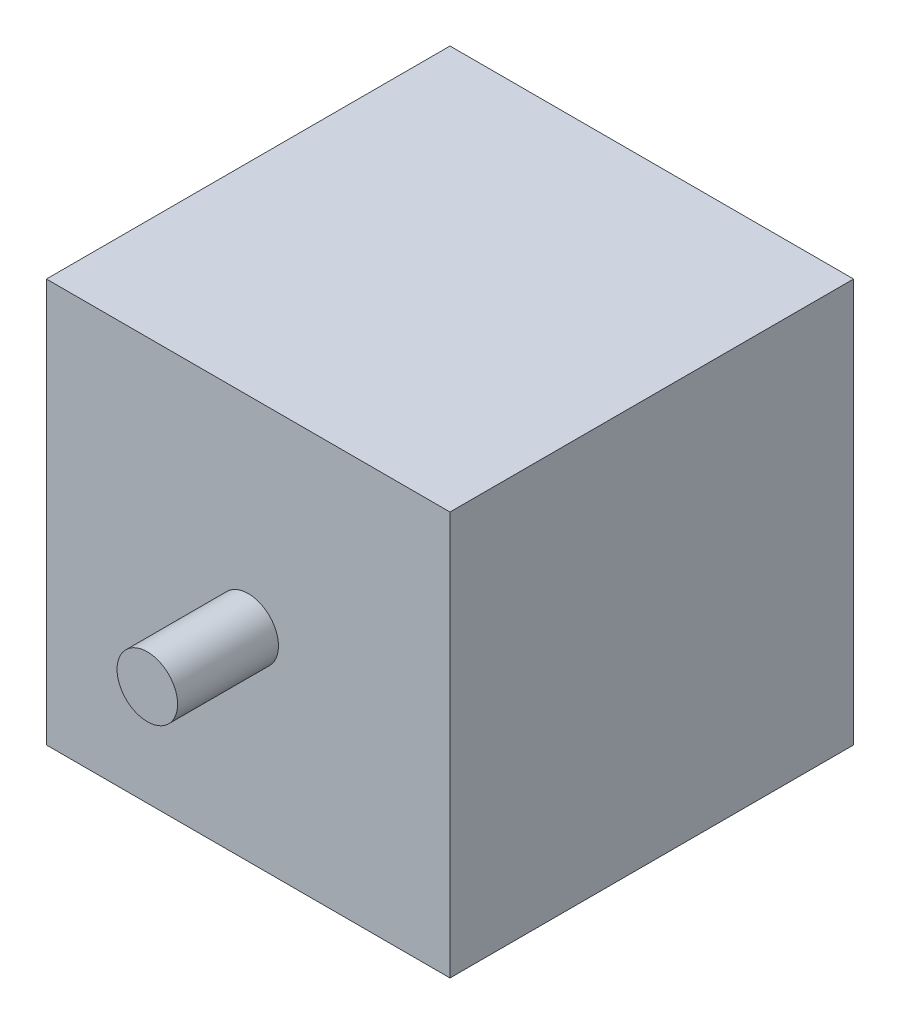
ISO-10303-21;
HEADER;
FILE_DESCRIPTION(('STEP AP214'),'2;1');
FILE_NAME('part.step','',(''),(''),'','','');
FILE_SCHEMA(('AUTOMOTIVE_DESIGN { 1 0 10303 214 1 1 1 1 }'));
ENDSEC;
DATA;
#1=APPLICATION_CONTEXT('core data for automotive mechanical design processes');
#2=APPLICATION_PROTOCOL_DEFINITION('international standard','automotive_design',2000,#1);
#3=PRODUCT_CONTEXT('',#1,'mechanical');
#4=PRODUCT('Part','Part','',(#3));
#5=PRODUCT_RELATED_PRODUCT_CATEGORY('part','',(#4));
#6=PRODUCT_DEFINITION_FORMATION('','',#4);
#7=PRODUCT_DEFINITION_CONTEXT('part definition',#1,'design');
#8=PRODUCT_DEFINITION('design','',#6,#7);
#9=PRODUCT_DEFINITION_SHAPE('','',#8);
#10=(LENGTH_UNIT() NAMED_UNIT(*) SI_UNIT(.MILLI.,.METRE.));
#11=(NAMED_UNIT(*) PLANE_ANGLE_UNIT() SI_UNIT($,.RADIAN.));
#12=(NAMED_UNIT(*) SI_UNIT($,.STERADIAN.) SOLID_ANGLE_UNIT());
#13=UNCERTAINTY_MEASURE_WITH_UNIT(LENGTH_MEASURE(1.E-05),#10,'distance_accuracy_value','');
#14=(GEOMETRIC_REPRESENTATION_CONTEXT(3) GLOBAL_UNCERTAINTY_ASSIGNED_CONTEXT((#13)) GLOBAL_UNIT_ASSIGNED_CONTEXT((#10,
#11,#12)) REPRESENTATION_CONTEXT('',''));
#15=CARTESIAN_POINT('',(0.,0.,0.));
#16=DIRECTION('',(0.,0.,1.));
#17=DIRECTION('',(1.,0.,0.));
#18=AXIS2_PLACEMENT_3D('',#15,#16,#17);
#19=CARTESIAN_POINT('',(20.,-20.,40.));
#20=DIRECTION('',(-1.,0.,0.));
#21=DIRECTION('',(0.,0.,1.));
#22=AXIS2_PLACEMENT_3D('',#19,#20,#21);
#23=PLANE('',#22);
#24=DIRECTION('',(0.,1.,0.));
#25=VECTOR('',#24,1.);
#26=CARTESIAN_POINT('',(20.,-20.,0.));
#27=LINE('',#26,#25);
#28=CARTESIAN_POINT('',(20.,-20.,0.));
#29=VERTEX_POINT('',#28);
#30=CARTESIAN_POINT('',(20.,20.,0.));
#31=VERTEX_POINT('',#30);
#32=EDGE_CURVE('E98',#29,#31,#27,.T.);
#33=ORIENTED_EDGE('',*,*,#32,.T.);
#34=DIRECTION('',(0.,0.,-1.));
#35=VECTOR('',#34,1.);
#36=CARTESIAN_POINT('',(20.,20.,40.));
#37=LINE('',#36,#35);
#38=CARTESIAN_POINT('',(20.,20.,40.));
#39=VERTEX_POINT('',#38);
#40=EDGE_CURVE('E40',#39,#31,#37,.T.);
#41=ORIENTED_EDGE('',*,*,#40,.F.);
#42=DIRECTION('',(0.,1.,0.));
#43=VECTOR('',#42,1.);
#44=CARTESIAN_POINT('',(20.,-20.,40.));
#45=LINE('',#44,#43);
#46=CARTESIAN_POINT('',(20.,-20.,40.));
#47=VERTEX_POINT('',#46);
#48=EDGE_CURVE('E84',#47,#39,#45,.T.);
#49=ORIENTED_EDGE('',*,*,#48,.F.);
#50=DIRECTION('',(0.,0.,-1.));
#51=VECTOR('',#50,1.);
#52=CARTESIAN_POINT('',(20.,-20.,40.));
#53=LINE('',#52,#51);
#54=EDGE_CURVE('E94',#47,#29,#53,.T.);
#55=ORIENTED_EDGE('',*,*,#54,.T.);
#56=EDGE_LOOP('',(#33,#41,#49,#55));
#57=FACE_BOUND('',#56,.T.);
#58=ADVANCED_FACE('F32',(#57),#23,.F.);
#59=CARTESIAN_POINT('',(-20.,20.,40.));
#60=DIRECTION('',(0.,-1.,0.));
#61=DIRECTION('',(0.,0.,-1.));
#62=AXIS2_PLACEMENT_3D('',#59,#60,#61);
#63=PLANE('',#62);
#64=DIRECTION('',(-1.,0.,0.));
#65=VECTOR('',#64,1.);
#66=CARTESIAN_POINT('',(-20.,20.,0.));
#67=LINE('',#66,#65);
#68=CARTESIAN_POINT('',(-20.,20.,0.));
#69=VERTEX_POINT('',#68);
#70=EDGE_CURVE('E89',#31,#69,#67,.T.);
#71=ORIENTED_EDGE('',*,*,#70,.T.);
#72=DIRECTION('',(0.,0.,-1.));
#73=VECTOR('',#72,1.);
#74=CARTESIAN_POINT('',(-20.,20.,40.));
#75=LINE('',#74,#73);
#76=CARTESIAN_POINT('',(-20.,20.,40.));
#77=VERTEX_POINT('',#76);
#78=EDGE_CURVE('E87',#77,#69,#75,.T.);
#79=ORIENTED_EDGE('',*,*,#78,.F.);
#80=DIRECTION('',(-1.,0.,0.));
#81=VECTOR('',#80,1.);
#82=CARTESIAN_POINT('',(-20.,20.,40.));
#83=LINE('',#82,#81);
#84=EDGE_CURVE('E79',#39,#77,#83,.T.);
#85=ORIENTED_EDGE('',*,*,#84,.F.);
#86=ORIENTED_EDGE('',*,*,#40,.T.);
#87=EDGE_LOOP('',(#71,#79,#85,#86));
#88=FACE_BOUND('',#87,.T.);
#89=ADVANCED_FACE('F88',(#88),#63,.F.);
#90=CARTESIAN_POINT('',(-20.,-20.,40.));
#91=DIRECTION('',(1.,0.,0.));
#92=DIRECTION('',(0.,0.,-1.));
#93=AXIS2_PLACEMENT_3D('',#90,#91,#92);
#94=PLANE('',#93);
#95=DIRECTION('',(0.,-1.,0.));
#96=VECTOR('',#95,1.);
#97=CARTESIAN_POINT('',(-20.,-20.,0.));
#98=LINE('',#97,#96);
#99=CARTESIAN_POINT('',(-20.,-20.,0.));
#100=VERTEX_POINT('',#99);
#101=EDGE_CURVE('E65',#69,#100,#98,.T.);
#102=ORIENTED_EDGE('',*,*,#101,.T.);
#103=DIRECTION('',(0.,0.,-1.));
#104=VECTOR('',#103,1.);
#105=CARTESIAN_POINT('',(-20.,-20.,40.));
#106=LINE('',#105,#104);
#107=CARTESIAN_POINT('',(-20.,-20.,40.));
#108=VERTEX_POINT('',#107);
#109=EDGE_CURVE('E90',#108,#100,#106,.T.);
#110=ORIENTED_EDGE('',*,*,#109,.F.);
#111=DIRECTION('',(0.,-1.,0.));
#112=VECTOR('',#111,1.);
#113=CARTESIAN_POINT('',(-20.,-20.,40.));
#114=LINE('',#113,#112);
#115=EDGE_CURVE('E82',#77,#108,#114,.T.);
#116=ORIENTED_EDGE('',*,*,#115,.F.);
#117=ORIENTED_EDGE('',*,*,#78,.T.);
#118=EDGE_LOOP('',(#102,#110,#116,#117));
#119=FACE_BOUND('',#118,.T.);
#120=ADVANCED_FACE('F92',(#119),#94,.F.);
#121=CARTESIAN_POINT('',(-20.,-20.,40.));
#122=DIRECTION('',(0.,1.,0.));
#123=DIRECTION('',(0.,0.,1.));
#124=AXIS2_PLACEMENT_3D('',#121,#122,#123);
#125=PLANE('',#124);
#126=DIRECTION('',(1.,0.,0.));
#127=VECTOR('',#126,1.);
#128=CARTESIAN_POINT('',(-20.,-20.,0.));
#129=LINE('',#128,#127);
#130=EDGE_CURVE('E71',#100,#29,#129,.T.);
#131=ORIENTED_EDGE('',*,*,#130,.T.);
#132=ORIENTED_EDGE('',*,*,#54,.F.);
#133=DIRECTION('',(1.,0.,0.));
#134=VECTOR('',#133,1.);
#135=CARTESIAN_POINT('',(-20.,-20.,40.));
#136=LINE('',#135,#134);
#137=EDGE_CURVE('E48',#108,#47,#136,.T.);
#138=ORIENTED_EDGE('',*,*,#137,.F.);
#139=ORIENTED_EDGE('',*,*,#109,.T.);
#140=EDGE_LOOP('',(#131,#132,#138,#139));
#141=FACE_BOUND('',#140,.T.);
#142=ADVANCED_FACE('F120',(#141),#125,.F.);
#143=CARTESIAN_POINT('',(0.,0.,40.));
#144=DIRECTION('',(0.,0.,-1.));
#145=DIRECTION('',(-1.,0.,0.));
#146=AXIS2_PLACEMENT_3D('',#143,#144,#145);
#147=PLANE('',#146);
#148=CARTESIAN_POINT('',(0.,0.,40.));
#149=DIRECTION('',(0.,0.,-1.));
#150=DIRECTION('',(-1.,0.,0.));
#151=AXIS2_PLACEMENT_3D('',#148,#149,#150);
#152=CIRCLE('',#151,3.);
#153=CARTESIAN_POINT('',(-3.,0.,40.));
#154=VERTEX_POINT('',#153);
#155=EDGE_CURVE('E11',#154,#154,#152,.F.);
#156=ORIENTED_EDGE('',*,*,#155,.F.);
#157=EDGE_LOOP('',(#156));
#158=FACE_BOUND('',#157,.T.);
#159=ORIENTED_EDGE('',*,*,#48,.T.);
#160=ORIENTED_EDGE('',*,*,#84,.T.);
#161=ORIENTED_EDGE('',*,*,#115,.T.);
#162=ORIENTED_EDGE('',*,*,#137,.T.);
#163=EDGE_LOOP('',(#159,#160,#161,#162));
#164=FACE_BOUND('',#163,.T.);
#165=ADVANCED_FACE('F80',(#158,#164),#147,.F.);
#166=CARTESIAN_POINT('',(0.,0.,0.));
#167=DIRECTION('',(0.,0.,-1.));
#168=DIRECTION('',(-1.,0.,0.));
#169=AXIS2_PLACEMENT_3D('',#166,#167,#168);
#170=PLANE('',#169);
#171=ORIENTED_EDGE('',*,*,#32,.F.);
#172=ORIENTED_EDGE('',*,*,#130,.F.);
#173=ORIENTED_EDGE('',*,*,#101,.F.);
#174=ORIENTED_EDGE('',*,*,#70,.F.);
#175=EDGE_LOOP('',(#171,#172,#173,#174));
#176=FACE_BOUND('',#175,.T.);
#177=ADVANCED_FACE('F109',(#176),#170,.T.);
#178=CARTESIAN_POINT('',(0.,0.,50.));
#179=DIRECTION('',(0.,0.,-1.));
#180=DIRECTION('',(-1.,0.,0.));
#181=AXIS2_PLACEMENT_3D('',#178,#179,#180);
#182=CYLINDRICAL_SURFACE('',#181,3.);
#183=CARTESIAN_POINT('',(0.,0.,50.));
#184=DIRECTION('',(0.,0.,1.));
#185=DIRECTION('',(1.,0.,0.));
#186=AXIS2_PLACEMENT_3D('',#183,#184,#185);
#187=CIRCLE('',#186,3.);
#188=CARTESIAN_POINT('',(3.,0.,50.));
#189=VERTEX_POINT('',#188);
#190=EDGE_CURVE('E101',#189,#189,#187,.T.);
#191=ORIENTED_EDGE('',*,*,#190,.F.);
#192=EDGE_LOOP('',(#191));
#193=FACE_BOUND('',#192,.T.);
#194=ORIENTED_EDGE('',*,*,#155,.T.);
#195=EDGE_LOOP('',(#194));
#196=FACE_BOUND('',#195,.T.);
#197=ADVANCED_FACE('F111',(#193,#196),#182,.T.);
#198=CARTESIAN_POINT('',(0.,0.,50.));
#199=DIRECTION('',(0.,0.,1.));
#200=DIRECTION('',(1.,0.,0.));
#201=AXIS2_PLACEMENT_3D('',#198,#199,#200);
#202=PLANE('',#201);
#203=ORIENTED_EDGE('',*,*,#190,.T.);
#204=EDGE_LOOP('',(#203));
#205=FACE_BOUND('',#204,.T.);
#206=ADVANCED_FACE('F117',(#205),#202,.T.);
#207=CLOSED_SHELL('',(#58,#89,#120,#142,#165,#177,#197,#206));
#208=MANIFOLD_SOLID_BREP('B2',#207);
#209=ADVANCED_BREP_SHAPE_REPRESENTATION('',(#18,#208),#14);
#210=SHAPE_DEFINITION_REPRESENTATION(#9,#209);
ENDSEC;
END-ISO-10303-21;
